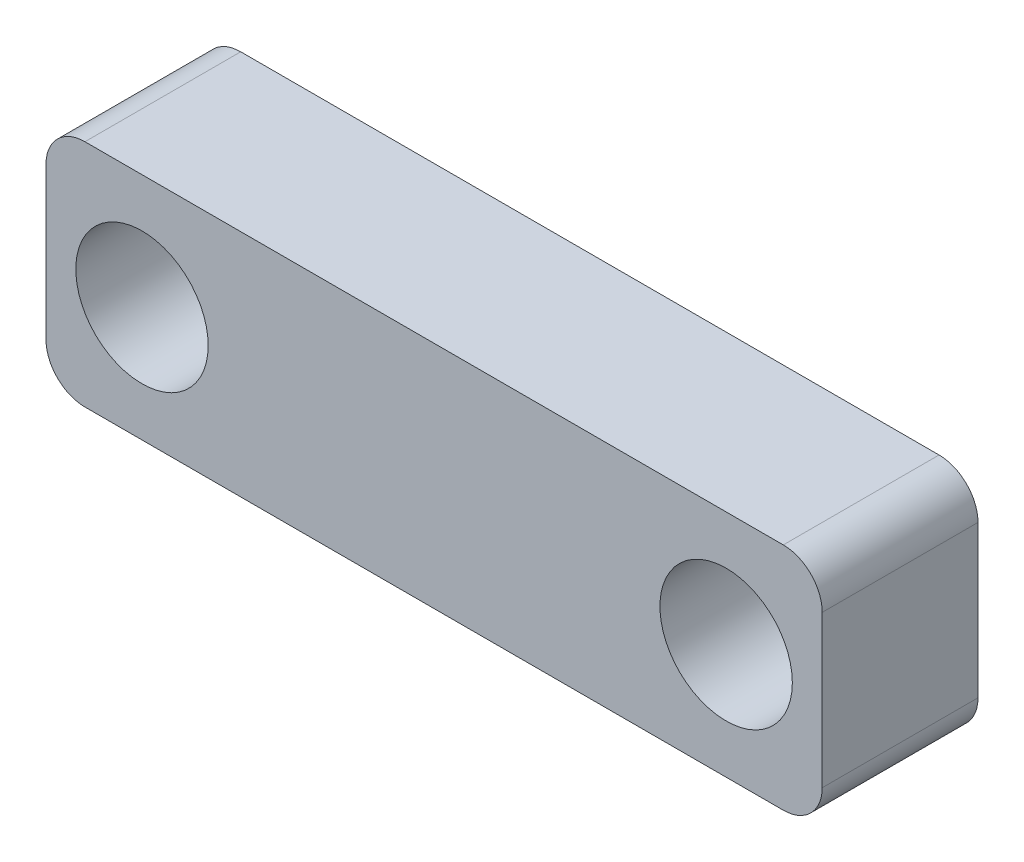
ISO-10303-21;
HEADER;
FILE_DESCRIPTION(('STEP AP214'),'2;1');
FILE_NAME('part.step','',(''),(''),'','','');
FILE_SCHEMA(('AUTOMOTIVE_DESIGN { 1 0 10303 214 1 1 1 1 }'));
ENDSEC;
DATA;
#1=APPLICATION_CONTEXT('core data for automotive mechanical design processes');
#2=APPLICATION_PROTOCOL_DEFINITION('international standard','automotive_design',2000,#1);
#3=PRODUCT_CONTEXT('',#1,'mechanical');
#4=PRODUCT('Part','Part','',(#3));
#5=PRODUCT_RELATED_PRODUCT_CATEGORY('part','',(#4));
#6=PRODUCT_DEFINITION_FORMATION('','',#4);
#7=PRODUCT_DEFINITION_CONTEXT('part definition',#1,'design');
#8=PRODUCT_DEFINITION('design','',#6,#7);
#9=PRODUCT_DEFINITION_SHAPE('','',#8);
#10=(LENGTH_UNIT() NAMED_UNIT(*) SI_UNIT(.MILLI.,.METRE.));
#11=(NAMED_UNIT(*) PLANE_ANGLE_UNIT() SI_UNIT($,.RADIAN.));
#12=(NAMED_UNIT(*) SI_UNIT($,.STERADIAN.) SOLID_ANGLE_UNIT());
#13=UNCERTAINTY_MEASURE_WITH_UNIT(LENGTH_MEASURE(1.E-05),#10,'distance_accuracy_value','');
#14=(GEOMETRIC_REPRESENTATION_CONTEXT(3) GLOBAL_UNCERTAINTY_ASSIGNED_CONTEXT((#13)) GLOBAL_UNIT_ASSIGNED_CONTEXT((#10,
#11,#12)) REPRESENTATION_CONTEXT('',''));
#15=CARTESIAN_POINT('',(0.,0.,0.));
#16=DIRECTION('',(0.,0.,1.));
#17=DIRECTION('',(1.,0.,0.));
#18=AXIS2_PLACEMENT_3D('',#15,#16,#17);
#19=CARTESIAN_POINT('',(-31.2221207225802,40.9398112558445,137.365661293432));
#20=DIRECTION('',(1.,0.,0.));
#21=DIRECTION('',(0.,0.,-1.));
#22=AXIS2_PLACEMENT_3D('',#19,#20,#21);
#23=PLANE('',#22);
#24=DIRECTION('',(0.,-1.,0.));
#25=VECTOR('',#24,1.);
#26=CARTESIAN_POINT('',(-31.2221207225802,40.9398112558445,133.365661293432));
#27=LINE('',#26,#25);
#28=CARTESIAN_POINT('',(-31.2221207225802,39.9398112558445,133.365661293432));
#29=VERTEX_POINT('',#28);
#30=CARTESIAN_POINT('',(-31.2221207225802,36.0398112558445,133.365661293432));
#31=VERTEX_POINT('',#30);
#32=EDGE_CURVE('E130',#29,#31,#27,.T.);
#33=ORIENTED_EDGE('',*,*,#32,.T.);
#34=DIRECTION('',(0.,0.,-1.));
#35=VECTOR('',#34,1.);
#36=CARTESIAN_POINT('',(-31.2221207225802,36.0398112558445,137.365661293432));
#37=LINE('',#36,#35);
#38=CARTESIAN_POINT('',(-31.2221207225802,36.0398112558445,137.365661293432));
#39=VERTEX_POINT('',#38);
#40=EDGE_CURVE('E11',#31,#39,#37,.F.);
#41=ORIENTED_EDGE('',*,*,#40,.T.);
#42=DIRECTION('',(0.,-1.,0.));
#43=VECTOR('',#42,1.);
#44=CARTESIAN_POINT('',(-31.2221207225802,40.9398112558445,137.365661293432));
#45=LINE('',#44,#43);
#46=CARTESIAN_POINT('',(-31.2221207225802,39.9398112558445,137.365661293432));
#47=VERTEX_POINT('',#46);
#48=EDGE_CURVE('E128',#47,#39,#45,.T.);
#49=ORIENTED_EDGE('',*,*,#48,.F.);
#50=DIRECTION('',(0.,0.,-1.));
#51=VECTOR('',#50,1.);
#52=CARTESIAN_POINT('',(-31.2221207225802,39.9398112558445,137.365661293432));
#53=LINE('',#52,#51);
#54=EDGE_CURVE('E41',#47,#29,#53,.T.);
#55=ORIENTED_EDGE('',*,*,#54,.T.);
#56=EDGE_LOOP('',(#33,#41,#49,#55));
#57=FACE_BOUND('',#56,.T.);
#58=ADVANCED_FACE('F32',(#57),#23,.F.);
#59=CARTESIAN_POINT('',(-31.2221207225802,35.0398112558445,137.365661293432));
#60=DIRECTION('',(0.,1.,0.));
#61=DIRECTION('',(0.,0.,1.));
#62=AXIS2_PLACEMENT_3D('',#59,#60,#61);
#63=PLANE('',#62);
#64=DIRECTION('',(1.,0.,0.));
#65=VECTOR('',#64,1.);
#66=CARTESIAN_POINT('',(-31.2221207225802,35.0398112558445,133.365661293432));
#67=LINE('',#66,#65);
#68=CARTESIAN_POINT('',(-30.2221207225802,35.0398112558445,133.365661293432));
#69=VERTEX_POINT('',#68);
#70=CARTESIAN_POINT('',(-12.2894893378649,35.0398112558445,133.365661293432));
#71=VERTEX_POINT('',#70);
#72=EDGE_CURVE('E126',#69,#71,#67,.T.);
#73=ORIENTED_EDGE('',*,*,#72,.T.);
#74=DIRECTION('',(0.,0.,-1.));
#75=VECTOR('',#74,1.);
#76=CARTESIAN_POINT('',(-12.2894893378649,35.0398112558445,137.365661293432));
#77=LINE('',#76,#75);
#78=CARTESIAN_POINT('',(-12.2894893378649,35.0398112558445,137.365661293432));
#79=VERTEX_POINT('',#78);
#80=EDGE_CURVE('E105',#71,#79,#77,.F.);
#81=ORIENTED_EDGE('',*,*,#80,.T.);
#82=DIRECTION('',(1.,0.,0.));
#83=VECTOR('',#82,1.);
#84=CARTESIAN_POINT('',(-31.2221207225802,35.0398112558445,137.365661293432));
#85=LINE('',#84,#83);
#86=CARTESIAN_POINT('',(-30.2221207225802,35.0398112558445,137.365661293432));
#87=VERTEX_POINT('',#86);
#88=EDGE_CURVE('E171',#87,#79,#85,.T.);
#89=ORIENTED_EDGE('',*,*,#88,.F.);
#90=DIRECTION('',(0.,0.,-1.));
#91=VECTOR('',#90,1.);
#92=CARTESIAN_POINT('',(-30.2221207225802,35.0398112558445,137.365661293432));
#93=LINE('',#92,#91);
#94=EDGE_CURVE('E110',#87,#69,#93,.T.);
#95=ORIENTED_EDGE('',*,*,#94,.T.);
#96=EDGE_LOOP('',(#73,#81,#89,#95));
#97=FACE_BOUND('',#96,.T.);
#98=ADVANCED_FACE('F190',(#97),#63,.F.);
#99=CARTESIAN_POINT('',(-11.2894893378649,40.9398112558445,137.365661293432));
#100=DIRECTION('',(-1.,0.,0.));
#101=DIRECTION('',(0.,-1.,0.));
#102=AXIS2_PLACEMENT_3D('',#99,#100,#101);
#103=PLANE('',#102);
#104=DIRECTION('',(0.,1.,0.));
#105=VECTOR('',#104,1.);
#106=CARTESIAN_POINT('',(-11.2894893378649,40.9398112558445,137.365661293432));
#107=LINE('',#106,#105);
#108=CARTESIAN_POINT('',(-11.2894893378649,36.0398112558445,137.365661293432));
#109=VERTEX_POINT('',#108);
#110=CARTESIAN_POINT('',(-11.2894893378649,39.9398112558445,137.365661293432));
#111=VERTEX_POINT('',#110);
#112=EDGE_CURVE('E119',#109,#111,#107,.T.);
#113=ORIENTED_EDGE('',*,*,#112,.F.);
#114=DIRECTION('',(0.,0.,-1.));
#115=VECTOR('',#114,1.);
#116=CARTESIAN_POINT('',(-11.2894893378649,36.0398112558445,137.365661293432));
#117=LINE('',#116,#115);
#118=CARTESIAN_POINT('',(-11.2894893378649,36.0398112558445,133.365661293432));
#119=VERTEX_POINT('',#118);
#120=EDGE_CURVE('E104',#109,#119,#117,.T.);
#121=ORIENTED_EDGE('',*,*,#120,.T.);
#122=DIRECTION('',(0.,1.,0.));
#123=VECTOR('',#122,1.);
#124=CARTESIAN_POINT('',(-11.2894893378649,40.9398112558445,133.365661293432));
#125=LINE('',#124,#123);
#126=CARTESIAN_POINT('',(-11.2894893378649,39.9398112558445,133.365661293432));
#127=VERTEX_POINT('',#126);
#128=EDGE_CURVE('E117',#119,#127,#125,.T.);
#129=ORIENTED_EDGE('',*,*,#128,.T.);
#130=DIRECTION('',(0.,0.,-1.));
#131=VECTOR('',#130,1.);
#132=CARTESIAN_POINT('',(-11.2894893378649,39.9398112558445,137.365661293432));
#133=LINE('',#132,#131);
#134=EDGE_CURVE('E121',#127,#111,#133,.F.);
#135=ORIENTED_EDGE('',*,*,#134,.T.);
#136=EDGE_LOOP('',(#113,#121,#129,#135));
#137=FACE_BOUND('',#136,.T.);
#138=ADVANCED_FACE('F116',(#137),#103,.F.);
#139=CARTESIAN_POINT('',(-31.2221207225802,40.9398112558445,137.365661293432));
#140=DIRECTION('',(0.,-1.,0.));
#141=DIRECTION('',(0.,0.,-1.));
#142=AXIS2_PLACEMENT_3D('',#139,#140,#141);
#143=PLANE('',#142);
#144=DIRECTION('',(-1.,0.,0.));
#145=VECTOR('',#144,1.);
#146=CARTESIAN_POINT('',(-31.2221207225802,40.9398112558445,137.365661293432));
#147=LINE('',#146,#145);
#148=CARTESIAN_POINT('',(-12.2894893378649,40.9398112558445,137.365661293432));
#149=VERTEX_POINT('',#148);
#150=CARTESIAN_POINT('',(-30.2221207225802,40.9398112558445,137.365661293432));
#151=VERTEX_POINT('',#150);
#152=EDGE_CURVE('E134',#149,#151,#147,.T.);
#153=ORIENTED_EDGE('',*,*,#152,.F.);
#154=DIRECTION('',(0.,0.,-1.));
#155=VECTOR('',#154,1.);
#156=CARTESIAN_POINT('',(-12.2894893378649,40.9398112558445,137.365661293432));
#157=LINE('',#156,#155);
#158=CARTESIAN_POINT('',(-12.2894893378649,40.9398112558445,133.365661293432));
#159=VERTEX_POINT('',#158);
#160=EDGE_CURVE('E151',#149,#159,#157,.T.);
#161=ORIENTED_EDGE('',*,*,#160,.T.);
#162=DIRECTION('',(-1.,0.,0.));
#163=VECTOR('',#162,1.);
#164=CARTESIAN_POINT('',(-31.2221207225802,40.9398112558445,133.365661293432));
#165=LINE('',#164,#163);
#166=CARTESIAN_POINT('',(-30.2221207225802,40.9398112558445,133.365661293432));
#167=VERTEX_POINT('',#166);
#168=EDGE_CURVE('E125',#159,#167,#165,.T.);
#169=ORIENTED_EDGE('',*,*,#168,.T.);
#170=DIRECTION('',(0.,0.,-1.));
#171=VECTOR('',#170,1.);
#172=CARTESIAN_POINT('',(-30.2221207225802,40.9398112558445,137.365661293432));
#173=LINE('',#172,#171);
#174=EDGE_CURVE('E49',#167,#151,#173,.F.);
#175=ORIENTED_EDGE('',*,*,#174,.T.);
#176=EDGE_LOOP('',(#153,#161,#169,#175));
#177=FACE_BOUND('',#176,.T.);
#178=ADVANCED_FACE('F193',(#177),#143,.F.);
#179=CARTESIAN_POINT('',(0.,0.,137.365661293432));
#180=DIRECTION('',(0.,0.,1.));
#181=DIRECTION('',(1.,0.,0.));
#182=AXIS2_PLACEMENT_3D('',#179,#180,#181);
#183=PLANE('',#182);
#184=CARTESIAN_POINT('',(-28.7571207225802,37.9898112558445,137.365661293432));
#185=DIRECTION('',(0.,0.,1.));
#186=DIRECTION('',(1.,0.,0.));
#187=AXIS2_PLACEMENT_3D('',#184,#185,#186);
#188=CIRCLE('',#187,1.7);
#189=CARTESIAN_POINT('',(-27.0571207225802,37.9898112558445,137.365661293432));
#190=VERTEX_POINT('',#189);
#191=EDGE_CURVE('E166',#190,#190,#188,.T.);
#192=ORIENTED_EDGE('',*,*,#191,.F.);
#193=EDGE_LOOP('',(#192));
#194=FACE_BOUND('',#193,.T.);
#195=CARTESIAN_POINT('',(-13.7571207225802,37.9898112558445,137.365661293432));
#196=DIRECTION('',(0.,0.,1.));
#197=DIRECTION('',(1.,0.,0.));
#198=AXIS2_PLACEMENT_3D('',#195,#196,#197);
#199=CIRCLE('',#198,1.7);
#200=CARTESIAN_POINT('',(-12.0571207225802,37.9898112558445,137.365661293432));
#201=VERTEX_POINT('',#200);
#202=EDGE_CURVE('E157',#201,#201,#199,.T.);
#203=ORIENTED_EDGE('',*,*,#202,.F.);
#204=EDGE_LOOP('',(#203));
#205=FACE_BOUND('',#204,.T.);
#206=ORIENTED_EDGE('',*,*,#88,.T.);
#207=CARTESIAN_POINT('',(-12.2894893378649,36.0398112558445,137.365661293432));
#208=DIRECTION('',(0.,0.,1.));
#209=DIRECTION('',(1.,0.,0.));
#210=AXIS2_PLACEMENT_3D('',#207,#208,#209);
#211=CIRCLE('',#210,1.);
#212=EDGE_CURVE('E148',#79,#109,#211,.T.);
#213=ORIENTED_EDGE('',*,*,#212,.T.);
#214=ORIENTED_EDGE('',*,*,#112,.T.);
#215=CARTESIAN_POINT('',(-12.2894893378649,39.9398112558445,137.365661293432));
#216=DIRECTION('',(0.,0.,1.));
#217=DIRECTION('',(1.,0.,0.));
#218=AXIS2_PLACEMENT_3D('',#215,#216,#217);
#219=CIRCLE('',#218,1.);
#220=EDGE_CURVE('E56',#111,#149,#219,.T.);
#221=ORIENTED_EDGE('',*,*,#220,.T.);
#222=ORIENTED_EDGE('',*,*,#152,.T.);
#223=CARTESIAN_POINT('',(-30.2221207225802,39.9398112558445,137.365661293432));
#224=DIRECTION('',(0.,0.,1.));
#225=DIRECTION('',(1.,0.,0.));
#226=AXIS2_PLACEMENT_3D('',#223,#224,#225);
#227=CIRCLE('',#226,1.);
#228=EDGE_CURVE('E143',#151,#47,#227,.T.);
#229=ORIENTED_EDGE('',*,*,#228,.T.);
#230=ORIENTED_EDGE('',*,*,#48,.T.);
#231=CARTESIAN_POINT('',(-30.2221207225802,36.0398112558445,137.365661293432));
#232=DIRECTION('',(0.,0.,1.));
#233=DIRECTION('',(1.,0.,0.));
#234=AXIS2_PLACEMENT_3D('',#231,#232,#233);
#235=CIRCLE('',#234,1.);
#236=EDGE_CURVE('E145',#39,#87,#235,.T.);
#237=ORIENTED_EDGE('',*,*,#236,.T.);
#238=EDGE_LOOP('',(#206,#213,#214,#221,#222,#229,#230,#237));
#239=FACE_BOUND('',#238,.T.);
#240=ADVANCED_FACE('F176',(#194,#205,#239),#183,.T.);
#241=CARTESIAN_POINT('',(0.,0.,133.365661293432));
#242=DIRECTION('',(0.,0.,1.));
#243=DIRECTION('',(1.,0.,0.));
#244=AXIS2_PLACEMENT_3D('',#241,#242,#243);
#245=PLANE('',#244);
#246=CARTESIAN_POINT('',(-28.7571207225802,37.9898112558445,133.365661293432));
#247=DIRECTION('',(0.,0.,1.));
#248=DIRECTION('',(1.,0.,0.));
#249=AXIS2_PLACEMENT_3D('',#246,#247,#248);
#250=CIRCLE('',#249,1.7);
#251=CARTESIAN_POINT('',(-27.0571207225802,37.9898112558445,133.365661293432));
#252=VERTEX_POINT('',#251);
#253=EDGE_CURVE('E36',#252,#252,#250,.T.);
#254=ORIENTED_EDGE('',*,*,#253,.T.);
#255=EDGE_LOOP('',(#254));
#256=FACE_BOUND('',#255,.T.);
#257=CARTESIAN_POINT('',(-13.7571207225802,37.9898112558445,133.365661293432));
#258=DIRECTION('',(0.,0.,1.));
#259=DIRECTION('',(1.,0.,0.));
#260=AXIS2_PLACEMENT_3D('',#257,#258,#259);
#261=CIRCLE('',#260,1.7);
#262=CARTESIAN_POINT('',(-12.0571207225802,37.9898112558445,133.365661293432));
#263=VERTEX_POINT('',#262);
#264=EDGE_CURVE('E155',#263,#263,#261,.T.);
#265=ORIENTED_EDGE('',*,*,#264,.T.);
#266=EDGE_LOOP('',(#265));
#267=FACE_BOUND('',#266,.T.);
#268=ORIENTED_EDGE('',*,*,#128,.F.);
#269=CARTESIAN_POINT('',(-12.2894893378649,36.0398112558445,133.365661293432));
#270=DIRECTION('',(0.,0.,1.));
#271=DIRECTION('',(1.,0.,0.));
#272=AXIS2_PLACEMENT_3D('',#269,#270,#271);
#273=CIRCLE('',#272,1.);
#274=EDGE_CURVE('E100',#119,#71,#273,.F.);
#275=ORIENTED_EDGE('',*,*,#274,.T.);
#276=ORIENTED_EDGE('',*,*,#72,.F.);
#277=CARTESIAN_POINT('',(-30.2221207225802,36.0398112558445,133.365661293432));
#278=DIRECTION('',(0.,0.,1.));
#279=DIRECTION('',(1.,0.,0.));
#280=AXIS2_PLACEMENT_3D('',#277,#278,#279);
#281=CIRCLE('',#280,1.);
#282=EDGE_CURVE('E137',#69,#31,#281,.F.);
#283=ORIENTED_EDGE('',*,*,#282,.T.);
#284=ORIENTED_EDGE('',*,*,#32,.F.);
#285=CARTESIAN_POINT('',(-30.2221207225802,39.9398112558445,133.365661293432));
#286=DIRECTION('',(0.,0.,1.));
#287=DIRECTION('',(1.,0.,0.));
#288=AXIS2_PLACEMENT_3D('',#285,#286,#287);
#289=CIRCLE('',#288,1.);
#290=EDGE_CURVE('E120',#29,#167,#289,.F.);
#291=ORIENTED_EDGE('',*,*,#290,.T.);
#292=ORIENTED_EDGE('',*,*,#168,.F.);
#293=CARTESIAN_POINT('',(-12.2894893378649,39.9398112558445,133.365661293432));
#294=DIRECTION('',(0.,0.,1.));
#295=DIRECTION('',(1.,0.,0.));
#296=AXIS2_PLACEMENT_3D('',#293,#294,#295);
#297=CIRCLE('',#296,1.);
#298=EDGE_CURVE('E111',#159,#127,#297,.F.);
#299=ORIENTED_EDGE('',*,*,#298,.T.);
#300=EDGE_LOOP('',(#268,#275,#276,#283,#284,#291,#292,#299));
#301=FACE_BOUND('',#300,.T.);
#302=ADVANCED_FACE('F123',(#256,#267,#301),#245,.F.);
#303=CARTESIAN_POINT('',(-12.2894893378649,36.0398112558445,137.365661293432));
#304=DIRECTION('',(0.,0.,-1.));
#305=DIRECTION('',(-1.,0.,0.));
#306=AXIS2_PLACEMENT_3D('',#303,#304,#305);
#307=CYLINDRICAL_SURFACE('',#306,1.);
#308=ORIENTED_EDGE('',*,*,#212,.F.);
#309=ORIENTED_EDGE('',*,*,#80,.F.);
#310=ORIENTED_EDGE('',*,*,#274,.F.);
#311=ORIENTED_EDGE('',*,*,#120,.F.);
#312=EDGE_LOOP('',(#308,#309,#310,#311));
#313=FACE_BOUND('',#312,.T.);
#314=ADVANCED_FACE('F103',(#313),#307,.T.);
#315=CARTESIAN_POINT('',(-12.2894893378649,39.9398112558445,137.365661293432));
#316=DIRECTION('',(0.,0.,-1.));
#317=DIRECTION('',(-1.,0.,0.));
#318=AXIS2_PLACEMENT_3D('',#315,#316,#317);
#319=CYLINDRICAL_SURFACE('',#318,1.);
#320=ORIENTED_EDGE('',*,*,#220,.F.);
#321=ORIENTED_EDGE('',*,*,#134,.F.);
#322=ORIENTED_EDGE('',*,*,#298,.F.);
#323=ORIENTED_EDGE('',*,*,#160,.F.);
#324=EDGE_LOOP('',(#320,#321,#322,#323));
#325=FACE_BOUND('',#324,.T.);
#326=ADVANCED_FACE('F192',(#325),#319,.T.);
#327=CARTESIAN_POINT('',(-30.2221207225802,36.0398112558445,137.365661293432));
#328=DIRECTION('',(0.,0.,-1.));
#329=DIRECTION('',(-1.,0.,0.));
#330=AXIS2_PLACEMENT_3D('',#327,#328,#329);
#331=CYLINDRICAL_SURFACE('',#330,1.);
#332=ORIENTED_EDGE('',*,*,#236,.F.);
#333=ORIENTED_EDGE('',*,*,#40,.F.);
#334=ORIENTED_EDGE('',*,*,#282,.F.);
#335=ORIENTED_EDGE('',*,*,#94,.F.);
#336=EDGE_LOOP('',(#332,#333,#334,#335));
#337=FACE_BOUND('',#336,.T.);
#338=ADVANCED_FACE('F187',(#337),#331,.T.);
#339=CARTESIAN_POINT('',(-30.2221207225802,39.9398112558445,137.365661293432));
#340=DIRECTION('',(0.,0.,-1.));
#341=DIRECTION('',(-1.,0.,0.));
#342=AXIS2_PLACEMENT_3D('',#339,#340,#341);
#343=CYLINDRICAL_SURFACE('',#342,1.);
#344=ORIENTED_EDGE('',*,*,#228,.F.);
#345=ORIENTED_EDGE('',*,*,#174,.F.);
#346=ORIENTED_EDGE('',*,*,#290,.F.);
#347=ORIENTED_EDGE('',*,*,#54,.F.);
#348=EDGE_LOOP('',(#344,#345,#346,#347));
#349=FACE_BOUND('',#348,.T.);
#350=ADVANCED_FACE('F34',(#349),#343,.T.);
#351=CARTESIAN_POINT('',(-13.7571207225802,37.9898112558445,137.365661293432));
#352=DIRECTION('',(0.,0.,1.));
#353=DIRECTION('',(1.,0.,0.));
#354=AXIS2_PLACEMENT_3D('',#351,#352,#353);
#355=CYLINDRICAL_SURFACE('',#354,1.7);
#356=ORIENTED_EDGE('',*,*,#202,.T.);
#357=EDGE_LOOP('',(#356));
#358=FACE_BOUND('',#357,.T.);
#359=ORIENTED_EDGE('',*,*,#264,.F.);
#360=EDGE_LOOP('',(#359));
#361=FACE_BOUND('',#360,.T.);
#362=ADVANCED_FACE('F218',(#358,#361),#355,.F.);
#363=CARTESIAN_POINT('',(-28.7571207225802,37.9898112558445,137.365661293432));
#364=DIRECTION('',(0.,0.,1.));
#365=DIRECTION('',(1.,0.,0.));
#366=AXIS2_PLACEMENT_3D('',#363,#364,#365);
#367=CYLINDRICAL_SURFACE('',#366,1.7);
#368=ORIENTED_EDGE('',*,*,#191,.T.);
#369=EDGE_LOOP('',(#368));
#370=FACE_BOUND('',#369,.T.);
#371=ORIENTED_EDGE('',*,*,#253,.F.);
#372=EDGE_LOOP('',(#371));
#373=FACE_BOUND('',#372,.T.);
#374=ADVANCED_FACE('F222',(#370,#373),#367,.F.);
#375=CLOSED_SHELL('',(#58,#98,#138,#178,#240,#302,#314,#326,#338,#350,#362,#374));
#376=MANIFOLD_SOLID_BREP('B2',#375);
#377=ADVANCED_BREP_SHAPE_REPRESENTATION('',(#18,#376),#14);
#378=SHAPE_DEFINITION_REPRESENTATION(#9,#377);
ENDSEC;
END-ISO-10303-21;
